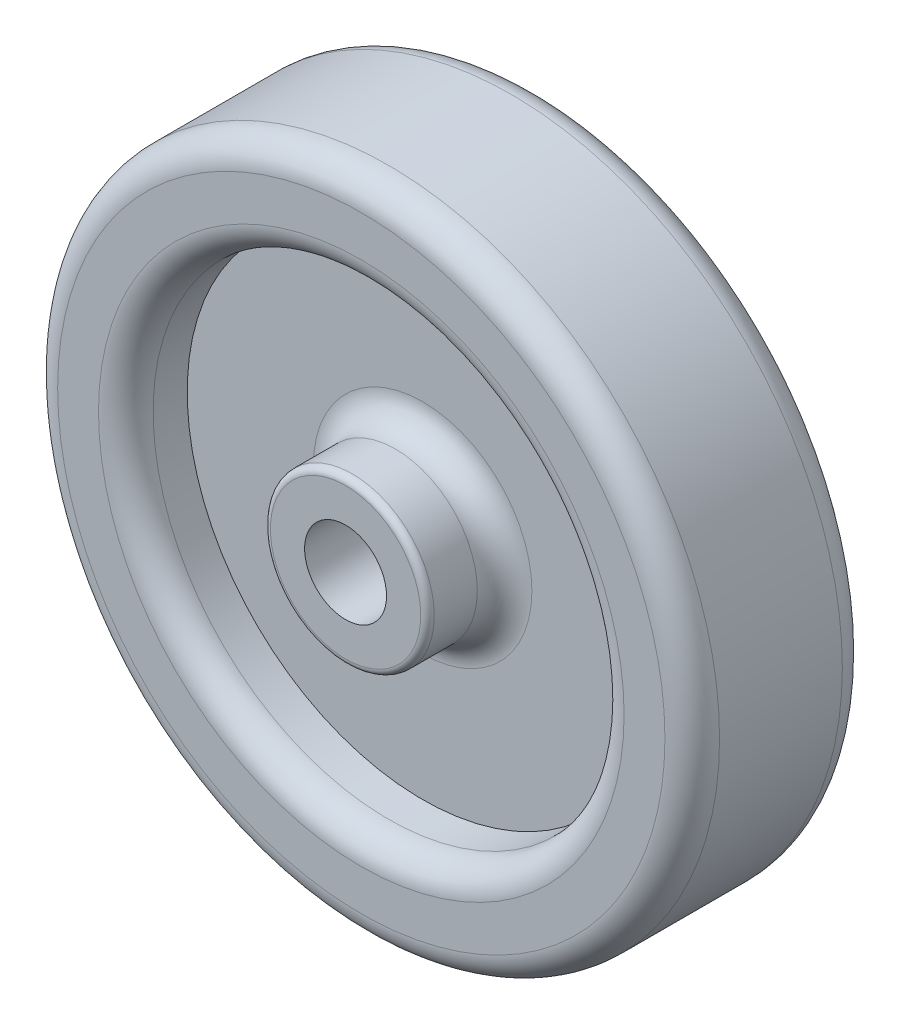
ISO-10303-21;
HEADER;
FILE_DESCRIPTION(('STEP AP214'),'2;1');
FILE_NAME('part.step','',(''),(''),'','','');
FILE_SCHEMA(('AUTOMOTIVE_DESIGN { 1 0 10303 214 1 1 1 1 }'));
ENDSEC;
DATA;
#1=APPLICATION_CONTEXT('core data for automotive mechanical design processes');
#2=APPLICATION_PROTOCOL_DEFINITION('international standard','automotive_design',2000,#1);
#3=PRODUCT_CONTEXT('',#1,'mechanical');
#4=PRODUCT('Part','Part','',(#3));
#5=PRODUCT_RELATED_PRODUCT_CATEGORY('part','',(#4));
#6=PRODUCT_DEFINITION_FORMATION('','',#4);
#7=PRODUCT_DEFINITION_CONTEXT('part definition',#1,'design');
#8=PRODUCT_DEFINITION('design','',#6,#7);
#9=PRODUCT_DEFINITION_SHAPE('','',#8);
#10=(LENGTH_UNIT() NAMED_UNIT(*) SI_UNIT(.MILLI.,.METRE.));
#11=(NAMED_UNIT(*) PLANE_ANGLE_UNIT() SI_UNIT($,.RADIAN.));
#12=(NAMED_UNIT(*) SI_UNIT($,.STERADIAN.) SOLID_ANGLE_UNIT());
#13=UNCERTAINTY_MEASURE_WITH_UNIT(LENGTH_MEASURE(1.E-05),#10,'distance_accuracy_value','');
#14=(GEOMETRIC_REPRESENTATION_CONTEXT(3) GLOBAL_UNCERTAINTY_ASSIGNED_CONTEXT((#13)) GLOBAL_UNIT_ASSIGNED_CONTEXT((#10,
#11,#12)) REPRESENTATION_CONTEXT('',''));
#15=CARTESIAN_POINT('',(0.,0.,0.));
#16=DIRECTION('',(0.,0.,1.));
#17=DIRECTION('',(1.,0.,0.));
#18=AXIS2_PLACEMENT_3D('',#15,#16,#17);
#19=CARTESIAN_POINT('',(0.,0.,10.31494));
#20=DIRECTION('',(0.,0.,1.));
#21=DIRECTION('',(1.,0.,0.));
#22=AXIS2_PLACEMENT_3D('',#19,#20,#21);
#23=PLANE('',#22);
#24=CARTESIAN_POINT('',(0.,0.,10.31494));
#25=DIRECTION('',(0.,0.,1.));
#26=DIRECTION('',(1.,0.,0.));
#27=AXIS2_PLACEMENT_3D('',#24,#25,#26);
#28=CIRCLE('',#27,35.306);
#29=CARTESIAN_POINT('',(35.306,0.,10.31494));
#30=VERTEX_POINT('',#29);
#31=EDGE_CURVE('E67',#30,#30,#28,.T.);
#32=ORIENTED_EDGE('',*,*,#31,.T.);
#33=EDGE_LOOP('',(#32));
#34=FACE_BOUND('',#33,.T.);
#35=CARTESIAN_POINT('',(0.,0.,10.31494));
#36=DIRECTION('',(0.,0.,1.));
#37=DIRECTION('',(1.,0.,0.));
#38=AXIS2_PLACEMENT_3D('',#35,#36,#37);
#39=CIRCLE('',#38,30.5562);
#40=CARTESIAN_POINT('',(30.5562,0.,10.31494));
#41=VERTEX_POINT('',#40);
#42=EDGE_CURVE('E70',#41,#41,#39,.F.);
#43=ORIENTED_EDGE('',*,*,#42,.T.);
#44=EDGE_LOOP('',(#43));
#45=FACE_BOUND('',#44,.T.);
#46=ADVANCED_FACE('F29',(#34,#45),#23,.T.);
#47=CARTESIAN_POINT('',(0.,0.,10.31494));
#48=DIRECTION('',(0.,0.,-1.));
#49=DIRECTION('',(-1.,0.,0.));
#50=AXIS2_PLACEMENT_3D('',#47,#48,#49);
#51=CYLINDRICAL_SURFACE('',#50,38.481);
#52=CARTESIAN_POINT('',(0.,0.,-7.1374));
#53=DIRECTION('',(0.,0.,1.));
#54=DIRECTION('',(1.,0.,0.));
#55=AXIS2_PLACEMENT_3D('',#52,#53,#54);
#56=CIRCLE('',#55,38.481);
#57=CARTESIAN_POINT('',(38.481,0.,-7.1374));
#58=VERTEX_POINT('',#57);
#59=EDGE_CURVE('E79',#58,#58,#56,.T.);
#60=ORIENTED_EDGE('',*,*,#59,.T.);
#61=EDGE_LOOP('',(#60));
#62=FACE_BOUND('',#61,.T.);
#63=CARTESIAN_POINT('',(0.,0.,7.13994));
#64=DIRECTION('',(0.,0.,1.));
#65=DIRECTION('',(1.,0.,0.));
#66=AXIS2_PLACEMENT_3D('',#63,#64,#65);
#67=CIRCLE('',#66,38.481);
#68=CARTESIAN_POINT('',(38.481,0.,7.13994));
#69=VERTEX_POINT('',#68);
#70=EDGE_CURVE('E82',#69,#69,#67,.F.);
#71=ORIENTED_EDGE('',*,*,#70,.T.);
#72=EDGE_LOOP('',(#71));
#73=FACE_BOUND('',#72,.T.);
#74=ADVANCED_FACE('F116',(#62,#73),#51,.T.);
#75=CARTESIAN_POINT('',(0.,0.,-10.3124));
#76=DIRECTION('',(0.,0.,1.));
#77=DIRECTION('',(1.,0.,0.));
#78=AXIS2_PLACEMENT_3D('',#75,#76,#77);
#79=PLANE('',#78);
#80=CARTESIAN_POINT('',(0.,0.,-10.3124));
#81=DIRECTION('',(0.,0.,1.));
#82=DIRECTION('',(1.,0.,0.));
#83=AXIS2_PLACEMENT_3D('',#80,#81,#82);
#84=CIRCLE('',#83,35.306);
#85=CARTESIAN_POINT('',(35.306,0.,-10.3124));
#86=VERTEX_POINT('',#85);
#87=EDGE_CURVE('E73',#86,#86,#84,.F.);
#88=ORIENTED_EDGE('',*,*,#87,.T.);
#89=EDGE_LOOP('',(#88));
#90=FACE_BOUND('',#89,.T.);
#91=CARTESIAN_POINT('',(0.,0.,-10.3124));
#92=DIRECTION('',(0.,0.,1.));
#93=DIRECTION('',(1.,0.,0.));
#94=AXIS2_PLACEMENT_3D('',#91,#92,#93);
#95=CIRCLE('',#94,30.5562);
#96=CARTESIAN_POINT('',(30.5562,0.,-10.3124));
#97=VERTEX_POINT('',#96);
#98=EDGE_CURVE('E76',#97,#97,#95,.T.);
#99=ORIENTED_EDGE('',*,*,#98,.T.);
#100=EDGE_LOOP('',(#99));
#101=FACE_BOUND('',#100,.T.);
#102=ADVANCED_FACE('F122',(#90,#101),#79,.F.);
#103=CARTESIAN_POINT('',(0.,0.,-12.13866));
#104=DIRECTION('',(0.,0.,1.));
#105=DIRECTION('',(1.,0.,0.));
#106=AXIS2_PLACEMENT_3D('',#103,#104,#105);
#107=CYLINDRICAL_SURFACE('',#106,9.525);
#108=CARTESIAN_POINT('',(0.,0.,-11.35126));
#109=DIRECTION('',(0.,0.,1.));
#110=DIRECTION('',(1.,0.,0.));
#111=AXIS2_PLACEMENT_3D('',#108,#109,#110);
#112=CIRCLE('',#111,9.525);
#113=CARTESIAN_POINT('',(9.525,0.,-11.35126));
#114=VERTEX_POINT('',#113);
#115=EDGE_CURVE('E44',#114,#114,#112,.T.);
#116=ORIENTED_EDGE('',*,*,#115,.T.);
#117=EDGE_LOOP('',(#116));
#118=FACE_BOUND('',#117,.T.);
#119=CARTESIAN_POINT('',(0.,0.,-6.35));
#120=DIRECTION('',(0.,0.,-1.));
#121=DIRECTION('',(-1.,0.,0.));
#122=AXIS2_PLACEMENT_3D('',#119,#120,#121);
#123=CIRCLE('',#122,9.525);
#124=CARTESIAN_POINT('',(-9.525,0.,-6.35));
#125=VERTEX_POINT('',#124);
#126=EDGE_CURVE('E58',#125,#125,#123,.T.);
#127=ORIENTED_EDGE('',*,*,#126,.T.);
#128=EDGE_LOOP('',(#127));
#129=FACE_BOUND('',#128,.T.);
#130=ADVANCED_FACE('F163',(#118,#129),#107,.T.);
#131=CARTESIAN_POINT('',(0.,0.,-12.13866));
#132=DIRECTION('',(0.,0.,1.));
#133=DIRECTION('',(1.,0.,0.));
#134=AXIS2_PLACEMENT_3D('',#131,#132,#133);
#135=PLANE('',#134);
#136=CARTESIAN_POINT('',(0.,0.,-12.13866));
#137=DIRECTION('',(0.,0.,1.));
#138=DIRECTION('',(1.,0.,0.));
#139=AXIS2_PLACEMENT_3D('',#136,#137,#138);
#140=CIRCLE('',#139,8.7376);
#141=CARTESIAN_POINT('',(8.7376,0.,-12.13866));
#142=VERTEX_POINT('',#141);
#143=EDGE_CURVE('E40',#142,#142,#140,.F.);
#144=ORIENTED_EDGE('',*,*,#143,.T.);
#145=EDGE_LOOP('',(#144));
#146=FACE_BOUND('',#145,.T.);
#147=CARTESIAN_POINT('',(0.,0.,-12.13866));
#148=DIRECTION('',(0.,0.,1.));
#149=DIRECTION('',(1.,0.,0.));
#150=AXIS2_PLACEMENT_3D('',#147,#148,#149);
#151=CIRCLE('',#150,4.7625);
#152=CARTESIAN_POINT('',(4.7625,0.,-12.13866));
#153=VERTEX_POINT('',#152);
#154=EDGE_CURVE('E85',#153,#153,#151,.T.);
#155=ORIENTED_EDGE('',*,*,#154,.T.);
#156=EDGE_LOOP('',(#155));
#157=FACE_BOUND('',#156,.T.);
#158=ADVANCED_FACE('F166',(#146,#157),#135,.F.);
#159=CARTESIAN_POINT('',(0.,0.,10.31494));
#160=DIRECTION('',(0.,0.,-1.));
#161=DIRECTION('',(-1.,0.,0.));
#162=AXIS2_PLACEMENT_3D('',#159,#160,#161);
#163=CYLINDRICAL_SURFACE('',#162,4.7625);
#164=ORIENTED_EDGE('',*,*,#154,.F.);
#165=EDGE_LOOP('',(#164));
#166=FACE_BOUND('',#165,.T.);
#167=CARTESIAN_POINT('',(0.,0.,12.14374));
#168=DIRECTION('',(0.,0.,1.));
#169=DIRECTION('',(1.,0.,0.));
#170=AXIS2_PLACEMENT_3D('',#167,#168,#169);
#171=CIRCLE('',#170,4.7625);
#172=CARTESIAN_POINT('',(4.7625,0.,12.14374));
#173=VERTEX_POINT('',#172);
#174=EDGE_CURVE('E88',#173,#173,#171,.T.);
#175=ORIENTED_EDGE('',*,*,#174,.T.);
#176=EDGE_LOOP('',(#175));
#177=FACE_BOUND('',#176,.T.);
#178=ADVANCED_FACE('F127',(#166,#177),#163,.F.);
#179=CARTESIAN_POINT('',(0.,0.,11.35634));
#180=DIRECTION('',(0.,0.,1.));
#181=DIRECTION('',(1.,0.,0.));
#182=AXIS2_PLACEMENT_3D('',#179,#180,#181);
#183=CIRCLE('',#182,9.525);
#184=CARTESIAN_POINT('',(9.525,0.,11.35634));
#185=VERTEX_POINT('',#184);
#186=EDGE_CURVE('E10',#185,#185,#183,.F.);
#187=ORIENTED_EDGE('',*,*,#186,.T.);
#188=EDGE_LOOP('',(#187));
#189=FACE_BOUND('',#188,.T.);
#190=CARTESIAN_POINT('',(0.,0.,6.35254));
#191=DIRECTION('',(0.,0.,1.));
#192=DIRECTION('',(1.,0.,0.));
#193=AXIS2_PLACEMENT_3D('',#190,#191,#192);
#194=CIRCLE('',#193,9.525);
#195=CARTESIAN_POINT('',(9.525,0.,6.35254));
#196=VERTEX_POINT('',#195);
#197=EDGE_CURVE('E64',#196,#196,#194,.T.);
#198=ORIENTED_EDGE('',*,*,#197,.T.);
#199=EDGE_LOOP('',(#198));
#200=FACE_BOUND('',#199,.T.);
#201=ADVANCED_FACE('F168',(#189,#200),#107,.T.);
#202=CARTESIAN_POINT('',(0.,0.,12.14374));
#203=DIRECTION('',(0.,0.,1.));
#204=DIRECTION('',(1.,0.,0.));
#205=AXIS2_PLACEMENT_3D('',#202,#203,#204);
#206=PLANE('',#205);
#207=CARTESIAN_POINT('',(0.,0.,12.14374));
#208=DIRECTION('',(0.,0.,1.));
#209=DIRECTION('',(1.,0.,0.));
#210=AXIS2_PLACEMENT_3D('',#207,#208,#209);
#211=CIRCLE('',#210,8.7376);
#212=CARTESIAN_POINT('',(8.7376,0.,12.14374));
#213=VERTEX_POINT('',#212);
#214=EDGE_CURVE('E36',#213,#213,#211,.T.);
#215=ORIENTED_EDGE('',*,*,#214,.T.);
#216=EDGE_LOOP('',(#215));
#217=FACE_BOUND('',#216,.T.);
#218=ORIENTED_EDGE('',*,*,#174,.F.);
#219=EDGE_LOOP('',(#218));
#220=FACE_BOUND('',#219,.T.);
#221=ADVANCED_FACE('F179',(#217,#220),#206,.T.);
#222=CARTESIAN_POINT('',(0.,0.,-3.175));
#223=DIRECTION('',(0.,0.,-1.));
#224=DIRECTION('',(-1.,0.,0.));
#225=AXIS2_PLACEMENT_3D('',#222,#223,#224);
#226=CYLINDRICAL_SURFACE('',#225,27.3812);
#227=CARTESIAN_POINT('',(0.,0.,-7.1374));
#228=DIRECTION('',(0.,0.,1.));
#229=DIRECTION('',(1.,0.,0.));
#230=AXIS2_PLACEMENT_3D('',#227,#228,#229);
#231=CIRCLE('',#230,27.3812);
#232=CARTESIAN_POINT('',(27.3812,0.,-7.1374));
#233=VERTEX_POINT('',#232);
#234=EDGE_CURVE('E49',#233,#233,#231,.F.);
#235=ORIENTED_EDGE('',*,*,#234,.T.);
#236=EDGE_LOOP('',(#235));
#237=FACE_BOUND('',#236,.T.);
#238=CARTESIAN_POINT('',(0.,0.,-3.175));
#239=DIRECTION('',(0.,0.,-1.));
#240=DIRECTION('',(-1.,0.,0.));
#241=AXIS2_PLACEMENT_3D('',#238,#239,#240);
#242=CIRCLE('',#241,27.3812);
#243=CARTESIAN_POINT('',(-27.3812,0.,-3.175));
#244=VERTEX_POINT('',#243);
#245=EDGE_CURVE('E91',#244,#244,#242,.T.);
#246=ORIENTED_EDGE('',*,*,#245,.F.);
#247=EDGE_LOOP('',(#246));
#248=FACE_BOUND('',#247,.T.);
#249=ADVANCED_FACE('F112',(#237,#248),#226,.F.);
#250=CARTESIAN_POINT('',(0.,0.,-3.175));
#251=DIRECTION('',(0.,0.,-1.));
#252=DIRECTION('',(-1.,0.,0.));
#253=AXIS2_PLACEMENT_3D('',#250,#251,#252);
#254=PLANE('',#253);
#255=CARTESIAN_POINT('',(0.,0.,-3.175));
#256=DIRECTION('',(0.,0.,-1.));
#257=DIRECTION('',(-1.,0.,0.));
#258=AXIS2_PLACEMENT_3D('',#255,#256,#257);
#259=CIRCLE('',#258,12.7);
#260=CARTESIAN_POINT('',(-12.7,0.,-3.175));
#261=VERTEX_POINT('',#260);
#262=EDGE_CURVE('E55',#261,#261,#259,.F.);
#263=ORIENTED_EDGE('',*,*,#262,.T.);
#264=EDGE_LOOP('',(#263));
#265=FACE_BOUND('',#264,.T.);
#266=ORIENTED_EDGE('',*,*,#245,.T.);
#267=EDGE_LOOP('',(#266));
#268=FACE_BOUND('',#267,.T.);
#269=ADVANCED_FACE('F102',(#265,#268),#254,.T.);
#270=CARTESIAN_POINT('',(0.,0.,3.17754));
#271=DIRECTION('',(0.,0.,1.));
#272=DIRECTION('',(1.,0.,0.));
#273=AXIS2_PLACEMENT_3D('',#270,#271,#272);
#274=CYLINDRICAL_SURFACE('',#273,27.3812);
#275=CARTESIAN_POINT('',(0.,0.,7.13994));
#276=DIRECTION('',(0.,0.,1.));
#277=DIRECTION('',(1.,0.,0.));
#278=AXIS2_PLACEMENT_3D('',#275,#276,#277);
#279=CIRCLE('',#278,27.3812);
#280=CARTESIAN_POINT('',(27.3812,0.,7.13994));
#281=VERTEX_POINT('',#280);
#282=EDGE_CURVE('E52',#281,#281,#279,.T.);
#283=ORIENTED_EDGE('',*,*,#282,.T.);
#284=EDGE_LOOP('',(#283));
#285=FACE_BOUND('',#284,.T.);
#286=CARTESIAN_POINT('',(0.,0.,3.17754));
#287=DIRECTION('',(0.,0.,1.));
#288=DIRECTION('',(1.,0.,0.));
#289=AXIS2_PLACEMENT_3D('',#286,#287,#288);
#290=CIRCLE('',#289,27.3812);
#291=CARTESIAN_POINT('',(27.3812,0.,3.17754));
#292=VERTEX_POINT('',#291);
#293=EDGE_CURVE('E94',#292,#292,#290,.T.);
#294=ORIENTED_EDGE('',*,*,#293,.F.);
#295=EDGE_LOOP('',(#294));
#296=FACE_BOUND('',#295,.T.);
#297=ADVANCED_FACE('F100',(#285,#296),#274,.F.);
#298=CARTESIAN_POINT('',(0.,0.,3.17754));
#299=DIRECTION('',(0.,0.,1.));
#300=DIRECTION('',(1.,0.,0.));
#301=AXIS2_PLACEMENT_3D('',#298,#299,#300);
#302=PLANE('',#301);
#303=CARTESIAN_POINT('',(0.,0.,3.17754));
#304=DIRECTION('',(0.,0.,1.));
#305=DIRECTION('',(1.,0.,0.));
#306=AXIS2_PLACEMENT_3D('',#303,#304,#305);
#307=CIRCLE('',#306,12.7);
#308=CARTESIAN_POINT('',(12.7,0.,3.17754));
#309=VERTEX_POINT('',#308);
#310=EDGE_CURVE('E61',#309,#309,#307,.F.);
#311=ORIENTED_EDGE('',*,*,#310,.T.);
#312=EDGE_LOOP('',(#311));
#313=FACE_BOUND('',#312,.T.);
#314=ORIENTED_EDGE('',*,*,#293,.T.);
#315=EDGE_LOOP('',(#314));
#316=FACE_BOUND('',#315,.T.);
#317=ADVANCED_FACE('F98',(#313,#316),#302,.T.);
#318=CARTESIAN_POINT('',(0.,0.,-7.1374));
#319=DIRECTION('',(0.,0.,1.));
#320=DIRECTION('',(1.,0.,0.));
#321=AXIS2_PLACEMENT_3D('',#318,#319,#320);
#322=TOROIDAL_SURFACE('',#321,35.306,3.175);
#323=ORIENTED_EDGE('',*,*,#87,.F.);
#324=EDGE_LOOP('',(#323));
#325=FACE_BOUND('',#324,.T.);
#326=ORIENTED_EDGE('',*,*,#59,.F.);
#327=EDGE_LOOP('',(#326));
#328=FACE_BOUND('',#327,.T.);
#329=ADVANCED_FACE('F109',(#325,#328),#322,.T.);
#330=CARTESIAN_POINT('',(0.,0.,7.13994));
#331=DIRECTION('',(0.,0.,1.));
#332=DIRECTION('',(1.,0.,0.));
#333=AXIS2_PLACEMENT_3D('',#330,#331,#332);
#334=TOROIDAL_SURFACE('',#333,35.306,3.175);
#335=ORIENTED_EDGE('',*,*,#70,.F.);
#336=EDGE_LOOP('',(#335));
#337=FACE_BOUND('',#336,.T.);
#338=ORIENTED_EDGE('',*,*,#31,.F.);
#339=EDGE_LOOP('',(#338));
#340=FACE_BOUND('',#339,.T.);
#341=ADVANCED_FACE('F132',(#337,#340),#334,.T.);
#342=CARTESIAN_POINT('',(0.,0.,6.35254));
#343=DIRECTION('',(0.,0.,1.));
#344=DIRECTION('',(1.,0.,0.));
#345=AXIS2_PLACEMENT_3D('',#342,#343,#344);
#346=TOROIDAL_SURFACE('',#345,12.7,3.175);
#347=ORIENTED_EDGE('',*,*,#310,.F.);
#348=EDGE_LOOP('',(#347));
#349=FACE_BOUND('',#348,.T.);
#350=ORIENTED_EDGE('',*,*,#197,.F.);
#351=EDGE_LOOP('',(#350));
#352=FACE_BOUND('',#351,.T.);
#353=ADVANCED_FACE('F136',(#349,#352),#346,.F.);
#354=CARTESIAN_POINT('',(0.,0.,-6.35));
#355=DIRECTION('',(0.,0.,-1.));
#356=DIRECTION('',(-1.,0.,0.));
#357=AXIS2_PLACEMENT_3D('',#354,#355,#356);
#358=TOROIDAL_SURFACE('',#357,12.7,3.175);
#359=ORIENTED_EDGE('',*,*,#262,.F.);
#360=EDGE_LOOP('',(#359));
#361=FACE_BOUND('',#360,.T.);
#362=ORIENTED_EDGE('',*,*,#126,.F.);
#363=EDGE_LOOP('',(#362));
#364=FACE_BOUND('',#363,.T.);
#365=ADVANCED_FACE('F140',(#361,#364),#358,.F.);
#366=CARTESIAN_POINT('',(0.,0.,7.13994));
#367=DIRECTION('',(0.,0.,1.));
#368=DIRECTION('',(1.,0.,0.));
#369=AXIS2_PLACEMENT_3D('',#366,#367,#368);
#370=TOROIDAL_SURFACE('',#369,30.5562,3.175);
#371=ORIENTED_EDGE('',*,*,#42,.F.);
#372=EDGE_LOOP('',(#371));
#373=FACE_BOUND('',#372,.T.);
#374=ORIENTED_EDGE('',*,*,#282,.F.);
#375=EDGE_LOOP('',(#374));
#376=FACE_BOUND('',#375,.T.);
#377=ADVANCED_FACE('F144',(#373,#376),#370,.T.);
#378=CARTESIAN_POINT('',(0.,0.,-7.1374));
#379=DIRECTION('',(0.,0.,1.));
#380=DIRECTION('',(1.,0.,0.));
#381=AXIS2_PLACEMENT_3D('',#378,#379,#380);
#382=TOROIDAL_SURFACE('',#381,30.5562,3.175);
#383=ORIENTED_EDGE('',*,*,#98,.F.);
#384=EDGE_LOOP('',(#383));
#385=FACE_BOUND('',#384,.T.);
#386=ORIENTED_EDGE('',*,*,#234,.F.);
#387=EDGE_LOOP('',(#386));
#388=FACE_BOUND('',#387,.T.);
#389=ADVANCED_FACE('F148',(#385,#388),#382,.T.);
#390=CARTESIAN_POINT('',(0.,0.,-11.35126));
#391=DIRECTION('',(0.,0.,1.));
#392=DIRECTION('',(1.,0.,0.));
#393=AXIS2_PLACEMENT_3D('',#390,#391,#392);
#394=TOROIDAL_SURFACE('',#393,8.7376,0.7874);
#395=ORIENTED_EDGE('',*,*,#143,.F.);
#396=EDGE_LOOP('',(#395));
#397=FACE_BOUND('',#396,.T.);
#398=ORIENTED_EDGE('',*,*,#115,.F.);
#399=EDGE_LOOP('',(#398));
#400=FACE_BOUND('',#399,.T.);
#401=ADVANCED_FACE('F151',(#397,#400),#394,.T.);
#402=CARTESIAN_POINT('',(0.,0.,11.35634));
#403=DIRECTION('',(0.,0.,1.));
#404=DIRECTION('',(1.,0.,0.));
#405=AXIS2_PLACEMENT_3D('',#402,#403,#404);
#406=TOROIDAL_SURFACE('',#405,8.7376,0.7874);
#407=ORIENTED_EDGE('',*,*,#186,.F.);
#408=EDGE_LOOP('',(#407));
#409=FACE_BOUND('',#408,.T.);
#410=ORIENTED_EDGE('',*,*,#214,.F.);
#411=EDGE_LOOP('',(#410));
#412=FACE_BOUND('',#411,.T.);
#413=ADVANCED_FACE('F31',(#409,#412),#406,.T.);
#414=CLOSED_SHELL('',(#46,#74,#102,#130,#158,#178,#201,#221,#249,#269,#297,#317,#329,#341,#353,
#365,#377,#389,#401,#413));
#415=MANIFOLD_SOLID_BREP('B2',#414);
#416=ADVANCED_BREP_SHAPE_REPRESENTATION('',(#18,#415),#14);
#417=SHAPE_DEFINITION_REPRESENTATION(#9,#416);
ENDSEC;
END-ISO-10303-21;
